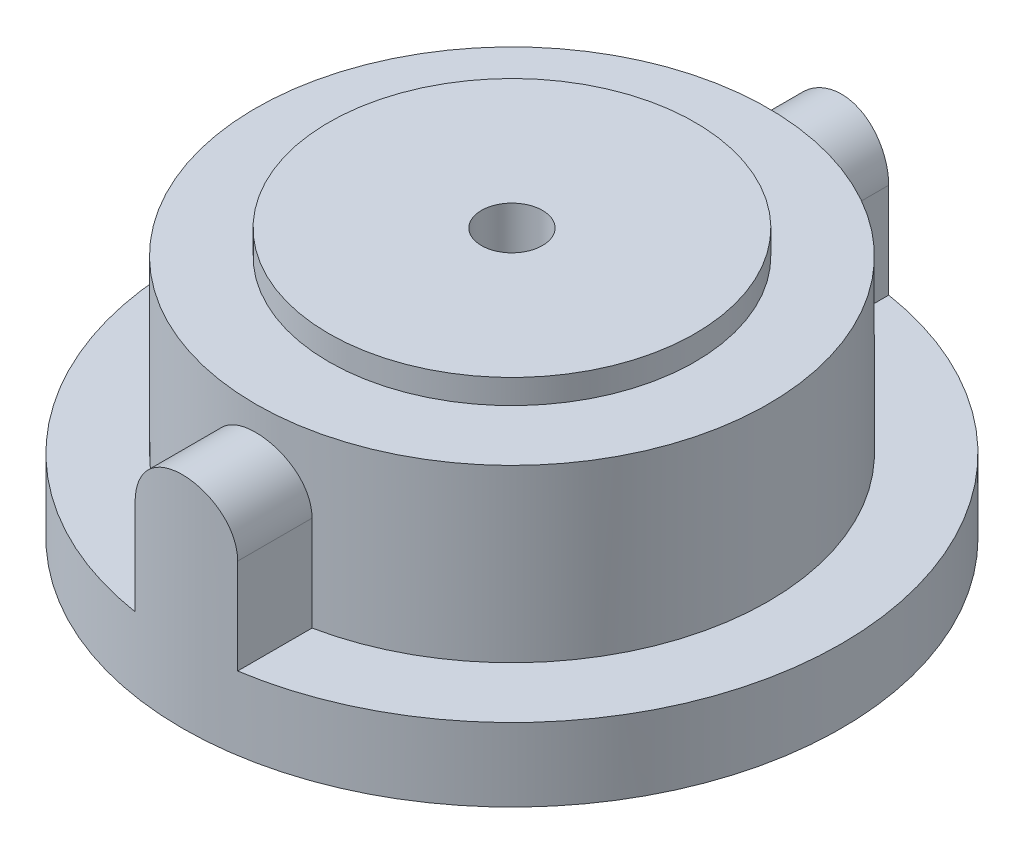
ISO-10303-21;
HEADER;
FILE_DESCRIPTION(('STEP AP214'),'2;1');
FILE_NAME('part.step','',(''),(''),'','','');
FILE_SCHEMA(('AUTOMOTIVE_DESIGN { 1 0 10303 214 1 1 1 1 }'));
ENDSEC;
DATA;
#1=APPLICATION_CONTEXT('core data for automotive mechanical design processes');
#2=APPLICATION_PROTOCOL_DEFINITION('international standard','automotive_design',2000,#1);
#3=PRODUCT_CONTEXT('',#1,'mechanical');
#4=PRODUCT('Part','Part','',(#3));
#5=PRODUCT_RELATED_PRODUCT_CATEGORY('part','',(#4));
#6=PRODUCT_DEFINITION_FORMATION('','',#4);
#7=PRODUCT_DEFINITION_CONTEXT('part definition',#1,'design');
#8=PRODUCT_DEFINITION('design','',#6,#7);
#9=PRODUCT_DEFINITION_SHAPE('','',#8);
#10=(LENGTH_UNIT() NAMED_UNIT(*) SI_UNIT(.MILLI.,.METRE.));
#11=(NAMED_UNIT(*) PLANE_ANGLE_UNIT() SI_UNIT($,.RADIAN.));
#12=(NAMED_UNIT(*) SI_UNIT($,.STERADIAN.) SOLID_ANGLE_UNIT());
#13=UNCERTAINTY_MEASURE_WITH_UNIT(LENGTH_MEASURE(1.E-05),#10,'distance_accuracy_value','');
#14=(GEOMETRIC_REPRESENTATION_CONTEXT(3) GLOBAL_UNCERTAINTY_ASSIGNED_CONTEXT((#13)) GLOBAL_UNIT_ASSIGNED_CONTEXT((#10,
#11,#12)) REPRESENTATION_CONTEXT('',''));
#15=CARTESIAN_POINT('',(0.,0.,0.));
#16=DIRECTION('',(0.,0.,1.));
#17=DIRECTION('',(1.,0.,0.));
#18=AXIS2_PLACEMENT_3D('',#15,#16,#17);
#19=CARTESIAN_POINT('',(0.,10.,0.));
#20=DIRECTION('',(0.,1.,0.));
#21=DIRECTION('',(0.,0.,1.));
#22=AXIS2_PLACEMENT_3D('',#19,#20,#21);
#23=PLANE('',#22);
#24=CARTESIAN_POINT('',(0.,10.,0.));
#25=DIRECTION('',(0.,1.,0.));
#26=DIRECTION('',(0.,0.,1.));
#27=AXIS2_PLACEMENT_3D('',#24,#25,#26);
#28=CIRCLE('',#27,10.5);
#29=CARTESIAN_POINT('',(0.,10.,10.5));
#30=VERTEX_POINT('',#29);
#31=EDGE_CURVE('E135',#30,#30,#28,.T.);
#32=ORIENTED_EDGE('',*,*,#31,.T.);
#33=EDGE_LOOP('',(#32));
#34=FACE_BOUND('',#33,.T.);
#35=CARTESIAN_POINT('',(0.,10.,0.));
#36=DIRECTION('',(0.,1.,0.));
#37=DIRECTION('',(0.,0.,1.));
#38=AXIS2_PLACEMENT_3D('',#35,#36,#37);
#39=CIRCLE('',#38,7.5);
#40=CARTESIAN_POINT('',(0.,10.,7.5));
#41=VERTEX_POINT('',#40);
#42=EDGE_CURVE('E235',#41,#41,#39,.T.);
#43=ORIENTED_EDGE('',*,*,#42,.F.);
#44=EDGE_LOOP('',(#43));
#45=FACE_BOUND('',#44,.T.);
#46=ADVANCED_FACE('F38',(#34,#45),#23,.T.);
#47=CARTESIAN_POINT('',(0.,3.,0.));
#48=DIRECTION('',(0.,1.,0.));
#49=DIRECTION('',(0.,0.,1.));
#50=AXIS2_PLACEMENT_3D('',#47,#48,#49);
#51=PLANE('',#50);
#52=CARTESIAN_POINT('',(0.,3.,0.));
#53=DIRECTION('',(0.,1.,0.));
#54=DIRECTION('',(0.,0.,1.));
#55=AXIS2_PLACEMENT_3D('',#52,#53,#54);
#56=CIRCLE('',#55,13.5);
#57=CARTESIAN_POINT('',(-2.1,3.,-13.3356664625357));
#58=VERTEX_POINT('',#57);
#59=CARTESIAN_POINT('',(-2.1,3.,13.3356664625357));
#60=VERTEX_POINT('',#59);
#61=EDGE_CURVE('E12',#58,#60,#56,.T.);
#62=ORIENTED_EDGE('',*,*,#61,.T.);
#63=DIRECTION('',(0.,0.,1.));
#64=VECTOR('',#63,1.);
#65=CARTESIAN_POINT('',(-2.1,3.,0.));
#66=LINE('',#65,#64);
#67=CARTESIAN_POINT('',(-2.1,3.,10.2878569196893));
#68=VERTEX_POINT('',#67);
#69=EDGE_CURVE('E148',#68,#60,#66,.T.);
#70=ORIENTED_EDGE('',*,*,#69,.F.);
#71=CARTESIAN_POINT('',(0.,3.,0.));
#72=DIRECTION('',(0.,1.,0.));
#73=DIRECTION('',(0.,0.,1.));
#74=AXIS2_PLACEMENT_3D('',#71,#72,#73);
#75=CIRCLE('',#74,10.5);
#76=CARTESIAN_POINT('',(-2.1,3.,-10.2878569196893));
#77=VERTEX_POINT('',#76);
#78=EDGE_CURVE('E130',#77,#68,#75,.T.);
#79=ORIENTED_EDGE('',*,*,#78,.F.);
#80=DIRECTION('',(0.,0.,1.));
#81=VECTOR('',#80,1.);
#82=CARTESIAN_POINT('',(-2.1,3.,0.));
#83=LINE('',#82,#81);
#84=EDGE_CURVE('E146',#58,#77,#83,.T.);
#85=ORIENTED_EDGE('',*,*,#84,.F.);
#86=EDGE_LOOP('',(#62,#70,#79,#85));
#87=FACE_BOUND('',#86,.T.);
#88=ADVANCED_FACE('F145',(#87),#51,.T.);
#89=DIRECTION('',(0.,0.,1.));
#90=VECTOR('',#89,1.);
#91=CARTESIAN_POINT('',(2.1,3.,0.));
#92=LINE('',#91,#90);
#93=CARTESIAN_POINT('',(2.1,3.,10.2878569196893));
#94=VERTEX_POINT('',#93);
#95=CARTESIAN_POINT('',(2.1,3.,13.3356664625357));
#96=VERTEX_POINT('',#95);
#97=EDGE_CURVE('E152',#94,#96,#92,.T.);
#98=ORIENTED_EDGE('',*,*,#97,.T.);
#99=CARTESIAN_POINT('',(2.1,3.,-13.3356664625357));
#100=VERTEX_POINT('',#99);
#101=EDGE_CURVE('E48',#96,#100,#56,.T.);
#102=ORIENTED_EDGE('',*,*,#101,.T.);
#103=DIRECTION('',(0.,0.,1.));
#104=VECTOR('',#103,1.);
#105=CARTESIAN_POINT('',(2.1,3.,0.));
#106=LINE('',#105,#104);
#107=CARTESIAN_POINT('',(2.1,3.,-10.2878569196893));
#108=VERTEX_POINT('',#107);
#109=EDGE_CURVE('E127',#100,#108,#106,.T.);
#110=ORIENTED_EDGE('',*,*,#109,.T.);
#111=EDGE_CURVE('E128',#94,#108,#75,.T.);
#112=ORIENTED_EDGE('',*,*,#111,.F.);
#113=EDGE_LOOP('',(#98,#102,#110,#112));
#114=FACE_BOUND('',#113,.T.);
#115=ADVANCED_FACE('F215',(#114),#51,.T.);
#116=CARTESIAN_POINT('',(0.,3.,0.));
#117=DIRECTION('',(0.,-1.,0.));
#118=DIRECTION('',(0.,0.,-1.));
#119=AXIS2_PLACEMENT_3D('',#116,#117,#118);
#120=CYLINDRICAL_SURFACE('',#119,13.5);
#121=DIRECTION('',(0.,-1.,0.));
#122=VECTOR('',#121,1.);
#123=CARTESIAN_POINT('',(-2.1,9.,-13.3356664625357));
#124=LINE('',#123,#122);
#125=CARTESIAN_POINT('',(-2.1,6.9,-13.3356664625357));
#126=VERTEX_POINT('',#125);
#127=EDGE_CURVE('E116',#126,#58,#124,.T.);
#128=ORIENTED_EDGE('',*,*,#127,.F.);
#129=CARTESIAN_POINT('',(-2.1,6.9,-13.3356664625357));
#130=CARTESIAN_POINT('',(-2.10000003362047,6.95870064975644,-13.3356641924813));
#131=CARTESIAN_POINT('',(-2.09753718442339,7.01737282326694,-13.3360545372154));
#132=CARTESIAN_POINT('',(-2.08771466942251,7.13429025313571,-13.3375966363139));
#133=CARTESIAN_POINT('',(-2.08035546026241,7.1925355487933,-13.3387483196744));
#134=CARTESIAN_POINT('',(-2.05101691857918,7.36585110547564,-13.3433034163251));
#135=CARTESIAN_POINT('',(-2.02177638968423,7.47974922625254,-13.3478070717655));
#136=CARTESIAN_POINT('',(-1.94479542652673,7.7009419188319,-13.3592389651343));
#137=CARTESIAN_POINT('',(-1.89705034064441,7.80823482236972,-13.3661678126576));
#138=CARTESIAN_POINT('',(-1.78444149214663,8.01330367226304,-13.3816660788076));
#139=CARTESIAN_POINT('',(-1.71957796427913,8.11107974909915,-13.3902354749366));
#140=CARTESIAN_POINT('',(-1.57398954621819,8.29514623524382,-13.4081303916358));
#141=CARTESIAN_POINT('',(-1.49314804578038,8.38134387123822,-13.4174611558056));
#142=CARTESIAN_POINT('',(-1.31814041919038,8.53901783325354,-13.4357817984866));
#143=CARTESIAN_POINT('',(-1.22397225856053,8.61049190744401,-13.4447716246833));
#144=CARTESIAN_POINT('',(-1.02438784875639,8.73702513755457,-13.4614521336257));
#145=CARTESIAN_POINT('',(-0.918916079951185,8.79199771152558,-13.4691358752226));
#146=CARTESIAN_POINT('',(-0.700102697374807,8.88340913153472,-13.4822792677039));
#147=CARTESIAN_POINT('',(-0.586761984493241,8.91985009523253,-13.4877391726982));
#148=CARTESIAN_POINT('',(-0.356389997957338,8.9728831296207,-13.4957829343775));
#149=CARTESIAN_POINT('',(-0.239395748450929,8.98963251894735,-13.4983895744565));
#150=CARTESIAN_POINT('',(-0.00422748842160446,9.00329577981471,-13.5005112868534));
#151=CARTESIAN_POINT('',(0.113946479814668,9.00021035979705,-13.5000264695892));
#152=CARTESIAN_POINT('',(0.347039414846936,8.97441453493813,-13.496037927127));
#153=CARTESIAN_POINT('',(0.461977684054823,8.95187393390199,-13.4925603235789));
#154=CARTESIAN_POINT('',(0.686419639987496,8.88807452940592,-13.4830060947168));
#155=CARTESIAN_POINT('',(0.795923211468582,8.84681532920286,-13.4769294143153));
#156=CARTESIAN_POINT('',(1.00690104171795,8.7465769447084,-13.4628149236582));
#157=CARTESIAN_POINT('',(1.10834086949709,8.68752644481789,-13.4547692456007));
#158=CARTESIAN_POINT('',(1.29993185871036,8.5534359883775,-13.4376129931583));
#159=CARTESIAN_POINT('',(1.3900826581905,8.47839551935821,-13.4285023846472));
#160=CARTESIAN_POINT('',(1.55753154571329,8.31352226052372,-13.4101185109453));
#161=CARTESIAN_POINT('',(1.63468545403143,8.22354306385022,-13.4008445409391));
#162=CARTESIAN_POINT('',(1.77284400077424,8.03180681211434,-13.3832690905538));
#163=CARTESIAN_POINT('',(1.8338439837955,7.93004637392989,-13.3749678909009));
#164=CARTESIAN_POINT('',(1.93798537767085,7.71746636610599,-13.3602766994743));
#165=CARTESIAN_POINT('',(1.98110065772168,7.60663382238528,-13.3538895079535));
#166=CARTESIAN_POINT('',(2.04800168154079,7.37925590665674,-13.3437945541188));
#167=CARTESIAN_POINT('',(2.07181637565083,7.26271936996768,-13.3400827796824));
#168=CARTESIAN_POINT('',(2.09043068831553,7.10442533170969,-13.3371702629415));
#169=CARTESIAN_POINT('',(2.09402074286844,7.0635885683473,-13.3366068099894));
#170=CARTESIAN_POINT('',(2.09880224708332,6.98184043580226,-13.3358553072576));
#171=CARTESIAN_POINT('',(2.09999772978293,6.94092930841583,-13.3356666262758));
#172=CARTESIAN_POINT('',(2.1,6.9,-13.3356664625357));
#173=B_SPLINE_CURVE_WITH_KNOTS('',3,(#129,#130,#131,#132,#133,#134,#135,#136,#137,#138,#139,
#140,#141,#142,#143,#144,#145,#146,#147,#148,#149,#150,#151,#152,#153,#154,#155,#156,#157,#158,
#159,#160,#161,#162,#163,#164,#165,#166,#167,#168,#169,#170,#171,#172),.UNSPECIFIED.,.F.,.F.,(4,
2,2,2,2,2,2,2,2,2,2,2,2,2,2,2,2,2,2,2,2,4),(0.,0.175992648583785,0.351968886063719,
0.703186358986229,1.05449217722208,1.40579317819486,1.75975958958644,2.11378009668888,
2.46962689410512,2.8254330187558,3.17837681566582,3.53130800652138,3.88118962777616,
4.23107866516356,4.58238930994889,4.93371121573431,5.28870501228497,5.64380100351718,
5.99941400282056,6.35449260012318,6.47743357075108,6.60016730437931),.UNSPECIFIED.);
#174=CARTESIAN_POINT('',(2.1,6.9,-13.3356664625357));
#175=VERTEX_POINT('',#174);
#176=EDGE_CURVE('E108',#126,#175,#173,.T.);
#177=ORIENTED_EDGE('',*,*,#176,.T.);
#178=DIRECTION('',(0.,-1.,0.));
#179=VECTOR('',#178,1.);
#180=CARTESIAN_POINT('',(2.1,9.,-13.3356664625357));
#181=LINE('',#180,#179);
#182=EDGE_CURVE('E113',#175,#100,#181,.T.);
#183=ORIENTED_EDGE('',*,*,#182,.T.);
#184=ORIENTED_EDGE('',*,*,#101,.F.);
#185=DIRECTION('',(0.,-1.,0.));
#186=VECTOR('',#185,1.);
#187=CARTESIAN_POINT('',(2.1,9.,13.3356664625357));
#188=LINE('',#187,#186);
#189=CARTESIAN_POINT('',(2.1,6.9,13.3356664625357));
#190=VERTEX_POINT('',#189);
#191=EDGE_CURVE('E151',#190,#96,#188,.T.);
#192=ORIENTED_EDGE('',*,*,#191,.F.);
#193=CARTESIAN_POINT('',(2.1,6.9,13.3356664625357));
#194=CARTESIAN_POINT('',(2.10000003362047,6.95870064975644,13.3356641924813));
#195=CARTESIAN_POINT('',(2.09753718442339,7.01737282326694,13.3360545372154));
#196=CARTESIAN_POINT('',(2.08771466942252,7.13429025313571,13.3375966363139));
#197=CARTESIAN_POINT('',(2.08035546026242,7.1925355487933,13.3387483196744));
#198=CARTESIAN_POINT('',(2.05101691857918,7.36585110547564,13.3433034163251));
#199=CARTESIAN_POINT('',(2.02177638968423,7.47974922625254,13.3478070717655));
#200=CARTESIAN_POINT('',(1.94479542652673,7.7009419188319,13.3592389651343));
#201=CARTESIAN_POINT('',(1.89705034064441,7.80823482236972,13.3661678126576));
#202=CARTESIAN_POINT('',(1.78444149214663,8.01330367226304,13.3816660788076));
#203=CARTESIAN_POINT('',(1.71957796427913,8.11107974909915,13.3902354749366));
#204=CARTESIAN_POINT('',(1.57398954621819,8.29514623524382,13.4081303916358));
#205=CARTESIAN_POINT('',(1.49314804578038,8.38134387123821,13.4174611558056));
#206=CARTESIAN_POINT('',(1.31814041919039,8.53901783325354,13.4357817984866));
#207=CARTESIAN_POINT('',(1.22397225856054,8.61049190744401,13.4447716246833));
#208=CARTESIAN_POINT('',(1.0243878487564,8.73702513755457,13.4614521336257));
#209=CARTESIAN_POINT('',(0.918916079951187,8.79199771152558,13.4691358752226));
#210=CARTESIAN_POINT('',(0.700102697374809,8.88340913153472,13.4822792677039));
#211=CARTESIAN_POINT('',(0.586761984493243,8.91985009523253,13.4877391726982));
#212=CARTESIAN_POINT('',(0.35638999795734,8.9728831296207,13.4957829343775));
#213=CARTESIAN_POINT('',(0.239395748450931,8.98963251894735,13.4983895744565));
#214=CARTESIAN_POINT('',(0.00422748842160757,9.00329577981471,13.5005112868534));
#215=CARTESIAN_POINT('',(-0.113946479814665,9.00021035979705,13.5000264695892));
#216=CARTESIAN_POINT('',(-0.347039414846933,8.97441453493813,13.496037927127));
#217=CARTESIAN_POINT('',(-0.461977684054821,8.95187393390199,13.4925603235789));
#218=CARTESIAN_POINT('',(-0.686419639987493,8.88807452940592,13.4830060947168));
#219=CARTESIAN_POINT('',(-0.795923211468579,8.84681532920286,13.4769294143153));
#220=CARTESIAN_POINT('',(-1.00690104171795,8.7465769447084,13.4628149236582));
#221=CARTESIAN_POINT('',(-1.10834086949709,8.68752644481789,13.4547692456007));
#222=CARTESIAN_POINT('',(-1.29993185871036,8.5534359883775,13.4376129931583));
#223=CARTESIAN_POINT('',(-1.3900826581905,8.47839551935821,13.4285023846472));
#224=CARTESIAN_POINT('',(-1.55753154571328,8.31352226052371,13.4101185109453));
#225=CARTESIAN_POINT('',(-1.63468545403143,8.22354306385022,13.4008445409391));
#226=CARTESIAN_POINT('',(-1.77284400077423,8.03180681211434,13.3832690905538));
#227=CARTESIAN_POINT('',(-1.83384398379549,7.93004637392989,13.3749678909009));
#228=CARTESIAN_POINT('',(-1.93798537767085,7.71746636610599,13.3602766994743));
#229=CARTESIAN_POINT('',(-1.98110065772168,7.60663382238528,13.3538895079535));
#230=CARTESIAN_POINT('',(-2.04800168154079,7.37925590665674,13.3437945541188));
#231=CARTESIAN_POINT('',(-2.07181637565083,7.26271936996768,13.3400827796824));
#232=CARTESIAN_POINT('',(-2.09043068831552,7.10442533170969,13.3371702629415));
#233=CARTESIAN_POINT('',(-2.09402074286844,7.0635885683473,13.3366068099894));
#234=CARTESIAN_POINT('',(-2.09880224708332,6.98184043580227,13.3358553072576));
#235=CARTESIAN_POINT('',(-2.09999772978292,6.94092930841583,13.3356666262758));
#236=CARTESIAN_POINT('',(-2.1,6.9,13.3356664625357));
#237=B_SPLINE_CURVE_WITH_KNOTS('',3,(#193,#194,#195,#196,#197,#198,#199,#200,#201,#202,#203,
#204,#205,#206,#207,#208,#209,#210,#211,#212,#213,#214,#215,#216,#217,#218,#219,#220,#221,#222,
#223,#224,#225,#226,#227,#228,#229,#230,#231,#232,#233,#234,#235,#236),.UNSPECIFIED.,.F.,.F.,(4,
2,2,2,2,2,2,2,2,2,2,2,2,2,2,2,2,2,2,2,2,4),(0.,0.175992648583785,0.351968886063719,
0.703186358986229,1.05449217722208,1.40579317819485,1.75975958958644,2.11378009668888,
2.46962689410512,2.8254330187558,3.17837681566581,3.53130800652137,3.88118962777616,
4.23107866516356,4.58238930994889,4.93371121573431,5.28870501228497,5.64380100351717,
5.99941400282056,6.35449260012317,6.47743357075107,6.60016730437931),.UNSPECIFIED.);
#238=CARTESIAN_POINT('',(-2.1,6.9,13.3356664625357));
#239=VERTEX_POINT('',#238);
#240=EDGE_CURVE('E170',#190,#239,#237,.T.);
#241=ORIENTED_EDGE('',*,*,#240,.T.);
#242=DIRECTION('',(0.,-1.,0.));
#243=VECTOR('',#242,1.);
#244=CARTESIAN_POINT('',(-2.1,9.,13.3356664625357));
#245=LINE('',#244,#243);
#246=EDGE_CURVE('E154',#239,#60,#245,.T.);
#247=ORIENTED_EDGE('',*,*,#246,.T.);
#248=ORIENTED_EDGE('',*,*,#61,.F.);
#249=EDGE_LOOP('',(#128,#177,#183,#184,#192,#241,#247,#248));
#250=FACE_BOUND('',#249,.T.);
#251=CARTESIAN_POINT('',(0.,0.,0.));
#252=DIRECTION('',(0.,1.,0.));
#253=DIRECTION('',(0.,0.,1.));
#254=AXIS2_PLACEMENT_3D('',#251,#252,#253);
#255=CIRCLE('',#254,13.5);
#256=CARTESIAN_POINT('',(0.,0.,13.5));
#257=VERTEX_POINT('',#256);
#258=EDGE_CURVE('E43',#257,#257,#255,.T.);
#259=ORIENTED_EDGE('',*,*,#258,.T.);
#260=EDGE_LOOP('',(#259));
#261=FACE_BOUND('',#260,.T.);
#262=ADVANCED_FACE('F40',(#250,#261),#120,.T.);
#263=CARTESIAN_POINT('',(0.,0.,0.));
#264=DIRECTION('',(0.,1.,0.));
#265=DIRECTION('',(0.,0.,1.));
#266=AXIS2_PLACEMENT_3D('',#263,#264,#265);
#267=PLANE('',#266);
#268=CARTESIAN_POINT('',(0.,0.,0.));
#269=DIRECTION('',(0.,-1.,0.));
#270=DIRECTION('',(0.,0.,-1.));
#271=AXIS2_PLACEMENT_3D('',#268,#269,#270);
#272=CIRCLE('',#271,1.25);
#273=CARTESIAN_POINT('',(0.,0.,-1.25));
#274=VERTEX_POINT('',#273);
#275=EDGE_CURVE('E242',#274,#274,#272,.T.);
#276=ORIENTED_EDGE('',*,*,#275,.F.);
#277=EDGE_LOOP('',(#276));
#278=FACE_BOUND('',#277,.T.);
#279=ORIENTED_EDGE('',*,*,#258,.F.);
#280=EDGE_LOOP('',(#279));
#281=FACE_BOUND('',#280,.T.);
#282=ADVANCED_FACE('F213',(#278,#281),#267,.F.);
#283=CARTESIAN_POINT('',(0.,10.,0.));
#284=DIRECTION('',(0.,-1.,0.));
#285=DIRECTION('',(0.,0.,-1.));
#286=AXIS2_PLACEMENT_3D('',#283,#284,#285);
#287=CYLINDRICAL_SURFACE('',#286,10.5);
#288=DIRECTION('',(0.,-1.,0.));
#289=VECTOR('',#288,1.);
#290=CARTESIAN_POINT('',(2.1,9.,-10.2878569196893));
#291=LINE('',#290,#289);
#292=CARTESIAN_POINT('',(2.1,6.9,-10.2878569196893));
#293=VERTEX_POINT('',#292);
#294=EDGE_CURVE('E55',#293,#108,#291,.T.);
#295=ORIENTED_EDGE('',*,*,#294,.F.);
#296=CARTESIAN_POINT('',(2.1,6.9,-10.2878569196893));
#297=CARTESIAN_POINT('',(2.10000031194499,6.95845049416363,-10.2878539171573));
#298=CARTESIAN_POINT('',(2.09755812425924,7.01687239074517,-10.288355683887));
#299=CARTESIAN_POINT('',(2.08781986170616,7.13328630745091,-10.2903374505764));
#300=CARTESIAN_POINT('',(2.0805243872912,7.19127837985595,-10.2918173295231));
#301=CARTESIAN_POINT('',(2.05145051952649,7.36379537431664,-10.2976679744941));
#302=CARTESIAN_POINT('',(2.02248433062436,7.47714600041121,-10.3034500459648));
#303=CARTESIAN_POINT('',(1.9462733014477,7.69724945315809,-10.3181154342176));
#304=CARTESIAN_POINT('',(1.8990264433902,7.80400154996915,-10.3269990933361));
#305=CARTESIAN_POINT('',(1.78763361926069,8.00809625614772,-10.3468621227054));
#306=CARTESIAN_POINT('',(1.72348590169835,8.10543788884861,-10.3578417101316));
#307=CARTESIAN_POINT('',(1.5791590696275,8.28927565703857,-10.3808307797072));
#308=CARTESIAN_POINT('',(1.49878869382543,8.3756201926817,-10.3928514666497));
#309=CARTESIAN_POINT('',(1.32470224108288,8.53370432250387,-10.4164709378978));
#310=CARTESIAN_POINT('',(1.23098410016753,8.60544165378401,-10.4280696566051));
#311=CARTESIAN_POINT('',(1.03185611214062,8.73285669193984,-10.4496590189784));
#312=CARTESIAN_POINT('',(0.926351632027486,8.78838923534584,-10.4596347929221));
#313=CARTESIAN_POINT('',(0.707282524428689,8.88087935755453,-10.4767268645444));
#314=CARTESIAN_POINT('',(0.59371909201272,8.91783968390741,-10.4838435851564));
#315=CARTESIAN_POINT('',(0.363336558662914,8.97166480178475,-10.4943366733168));
#316=CARTESIAN_POINT('',(0.246579972609596,8.98878765791618,-10.4977610329523));
#317=CARTESIAN_POINT('',(0.0118017411731779,9.00325705682065,-10.5006493566685));
#318=CARTESIAN_POINT('',(-0.106219811023037,9.00060504649472,-10.500113610505));
#319=CARTESIAN_POINT('',(-0.338398625789051,8.97579497921964,-10.4951791233203));
#320=CARTESIAN_POINT('',(-0.45258698805018,8.95391539519998,-10.4908355334659));
#321=CARTESIAN_POINT('',(-0.675637213763575,8.89171312835031,-10.4788356645369));
#322=CARTESIAN_POINT('',(-0.784498902896672,8.85138984238328,-10.4711792771292));
#323=CARTESIAN_POINT('',(-0.994602569757213,8.75318615265978,-10.453323071531));
#324=CARTESIAN_POINT('',(-1.09579202631459,8.6951963674555,-10.443107480213));
#325=CARTESIAN_POINT('',(-1.28710351955443,8.56338843241897,-10.4212594842126));
#326=CARTESIAN_POINT('',(-1.37722463806238,8.48956897082812,-10.4096269621479));
#327=CARTESIAN_POINT('',(-1.54548703373101,8.32668044058704,-10.3859917847386));
#328=CARTESIAN_POINT('',(-1.62339385949169,8.23736945564972,-10.3739862080765));
#329=CARTESIAN_POINT('',(-1.76318288978884,8.04680000717334,-10.3511458284449));
#330=CARTESIAN_POINT('',(-1.82506065508521,7.94553824515088,-10.3403113502936));
#331=CARTESIAN_POINT('',(-1.93111790475401,7.73358994961358,-10.3210323308887));
#332=CARTESIAN_POINT('',(-1.97524924093245,7.6228787508672,-10.3125943094652));
#333=CARTESIAN_POINT('',(-2.04415490439281,7.39547687436306,-10.2991593823124));
#334=CARTESIAN_POINT('',(-2.06895806771709,7.27879538203892,-10.294157351694));
#335=CARTESIAN_POINT('',(-2.08914917005613,7.11765068462249,-10.2900667210312));
#336=CARTESIAN_POINT('',(-2.09321963687657,7.07418630645688,-10.2892389573119));
#337=CARTESIAN_POINT('',(-2.09864164579577,6.98715448531141,-10.2881345151222));
#338=CARTESIAN_POINT('',(-2.09999773809978,6.94358733759285,-10.2878569144013));
#339=CARTESIAN_POINT('',(-2.1,6.9,-10.2878569196893));
#340=B_SPLINE_CURVE_WITH_KNOTS('',3,(#296,#297,#298,#299,#300,#301,#302,#303,#304,#305,#306,
#307,#308,#309,#310,#311,#312,#313,#314,#315,#316,#317,#318,#319,#320,#321,#322,#323,#324,#325,
#326,#327,#328,#329,#330,#331,#332,#333,#334,#335,#336,#337,#338,#339),.UNSPECIFIED.,.F.,.F.,(4,
2,2,2,2,2,2,2,2,2,2,2,2,2,2,2,2,2,2,2,2,4),(0.,0.175241871751633,0.350462066475223,
0.700058731089087,1.04969399448285,1.39936550596357,1.75342953378011,2.10754837034271,
2.46474834642953,2.82189546323662,3.17434236775853,3.52676348445606,3.87416308183209,
4.22157404051377,4.57118126967969,4.92081748096897,5.27650767345757,5.63229626909943,
5.98904375263664,6.3452579738636,6.47617741141929,6.60687719951593),.UNSPECIFIED.);
#341=CARTESIAN_POINT('',(-2.1,6.9,-10.2878569196893));
#342=VERTEX_POINT('',#341);
#343=EDGE_CURVE('E123',#293,#342,#340,.T.);
#344=ORIENTED_EDGE('',*,*,#343,.T.);
#345=DIRECTION('',(0.,-1.,0.));
#346=VECTOR('',#345,1.);
#347=CARTESIAN_POINT('',(-2.1,9.,-10.2878569196893));
#348=LINE('',#347,#346);
#349=EDGE_CURVE('E63',#342,#77,#348,.T.);
#350=ORIENTED_EDGE('',*,*,#349,.T.);
#351=ORIENTED_EDGE('',*,*,#78,.T.);
#352=DIRECTION('',(0.,-1.,0.));
#353=VECTOR('',#352,1.);
#354=CARTESIAN_POINT('',(-2.1,9.,10.2878569196893));
#355=LINE('',#354,#353);
#356=CARTESIAN_POINT('',(-2.1,6.9,10.2878569196893));
#357=VERTEX_POINT('',#356);
#358=EDGE_CURVE('E141',#357,#68,#355,.T.);
#359=ORIENTED_EDGE('',*,*,#358,.F.);
#360=CARTESIAN_POINT('',(2.1,6.9,10.2878569196893));
#361=CARTESIAN_POINT('',(2.10000031194499,6.95845049416363,10.2878539171573));
#362=CARTESIAN_POINT('',(2.09755812425924,7.01687239074517,10.288355683887));
#363=CARTESIAN_POINT('',(2.08781986170616,7.13328630745091,10.2903374505764));
#364=CARTESIAN_POINT('',(2.0805243872912,7.19127837985595,10.2918173295231));
#365=CARTESIAN_POINT('',(2.05145051952649,7.36379537431664,10.2976679744941));
#366=CARTESIAN_POINT('',(2.02248433062436,7.47714600041121,10.3034500459648));
#367=CARTESIAN_POINT('',(1.9462733014477,7.69724945315809,10.3181154342176));
#368=CARTESIAN_POINT('',(1.8990264433902,7.80400154996915,10.3269990933361));
#369=CARTESIAN_POINT('',(1.78763361926069,8.00809625614772,10.3468621227054));
#370=CARTESIAN_POINT('',(1.72348590169835,8.10543788884861,10.3578417101316));
#371=CARTESIAN_POINT('',(1.5791590696275,8.28927565703857,10.3808307797072));
#372=CARTESIAN_POINT('',(1.49878869382543,8.3756201926817,10.3928514666497));
#373=CARTESIAN_POINT('',(1.32470224108288,8.53370432250387,10.4164709378978));
#374=CARTESIAN_POINT('',(1.23098410016753,8.60544165378401,10.4280696566051));
#375=CARTESIAN_POINT('',(1.03185611214062,8.73285669193984,10.4496590189784));
#376=CARTESIAN_POINT('',(0.926351632027486,8.78838923534584,10.4596347929221));
#377=CARTESIAN_POINT('',(0.707282524428689,8.88087935755453,10.4767268645444));
#378=CARTESIAN_POINT('',(0.59371909201272,8.91783968390741,10.4838435851564));
#379=CARTESIAN_POINT('',(0.363336558662914,8.97166480178475,10.4943366733168));
#380=CARTESIAN_POINT('',(0.246579972609596,8.98878765791618,10.4977610329523));
#381=CARTESIAN_POINT('',(0.0118017411731779,9.00325705682065,10.5006493566685));
#382=CARTESIAN_POINT('',(-0.106219811023037,9.00060504649472,10.500113610505));
#383=CARTESIAN_POINT('',(-0.338398625789051,8.97579497921964,10.4951791233203));
#384=CARTESIAN_POINT('',(-0.45258698805018,8.95391539519998,10.4908355334659));
#385=CARTESIAN_POINT('',(-0.675637213763575,8.89171312835031,10.4788356645369));
#386=CARTESIAN_POINT('',(-0.784498902896672,8.85138984238328,10.4711792771292));
#387=CARTESIAN_POINT('',(-0.994602569757213,8.75318615265978,10.453323071531));
#388=CARTESIAN_POINT('',(-1.09579202631459,8.6951963674555,10.443107480213));
#389=CARTESIAN_POINT('',(-1.28710351955443,8.56338843241897,10.4212594842126));
#390=CARTESIAN_POINT('',(-1.37722463806238,8.48956897082812,10.4096269621479));
#391=CARTESIAN_POINT('',(-1.54548703373101,8.32668044058704,10.3859917847386));
#392=CARTESIAN_POINT('',(-1.62339385949169,8.23736945564972,10.3739862080765));
#393=CARTESIAN_POINT('',(-1.76318288978884,8.04680000717334,10.3511458284449));
#394=CARTESIAN_POINT('',(-1.82506065508521,7.94553824515088,10.3403113502936));
#395=CARTESIAN_POINT('',(-1.93111790475401,7.73358994961358,10.3210323308887));
#396=CARTESIAN_POINT('',(-1.97524924093245,7.6228787508672,10.3125943094652));
#397=CARTESIAN_POINT('',(-2.04415490439281,7.39547687436306,10.2991593823124));
#398=CARTESIAN_POINT('',(-2.06895806771709,7.27879538203892,10.294157351694));
#399=CARTESIAN_POINT('',(-2.08914917005613,7.11765068462249,10.2900667210312));
#400=CARTESIAN_POINT('',(-2.09321963687657,7.07418630645688,10.2892389573119));
#401=CARTESIAN_POINT('',(-2.09864164579577,6.98715448531141,10.2881345151222));
#402=CARTESIAN_POINT('',(-2.09999773809978,6.94358733759285,10.2878569144013));
#403=CARTESIAN_POINT('',(-2.1,6.9,10.2878569196893));
#404=B_SPLINE_CURVE_WITH_KNOTS('',3,(#360,#361,#362,#363,#364,#365,#366,#367,#368,#369,#370,
#371,#372,#373,#374,#375,#376,#377,#378,#379,#380,#381,#382,#383,#384,#385,#386,#387,#388,#389,
#390,#391,#392,#393,#394,#395,#396,#397,#398,#399,#400,#401,#402,#403),.UNSPECIFIED.,.F.,.F.,(4,
2,2,2,2,2,2,2,2,2,2,2,2,2,2,2,2,2,2,2,2,4),(0.,0.175241871751633,0.350462066475223,
0.700058731089087,1.04969399448285,1.39936550596357,1.75342953378011,2.10754837034271,
2.46474834642953,2.82189546323662,3.17434236775853,3.52676348445606,3.87416308183209,
4.22157404051377,4.57118126967969,4.92081748096897,5.27650767345757,5.63229626909943,
5.98904375263664,6.3452579738636,6.47617741141929,6.60687719951593),.UNSPECIFIED.);
#405=CARTESIAN_POINT('',(2.1,6.9,10.2878569196893));
#406=VERTEX_POINT('',#405);
#407=EDGE_CURVE('E157',#406,#357,#404,.T.);
#408=ORIENTED_EDGE('',*,*,#407,.F.);
#409=DIRECTION('',(0.,-1.,0.));
#410=VECTOR('',#409,1.);
#411=CARTESIAN_POINT('',(2.1,9.,10.2878569196893));
#412=LINE('',#411,#410);
#413=EDGE_CURVE('E163',#406,#94,#412,.T.);
#414=ORIENTED_EDGE('',*,*,#413,.T.);
#415=ORIENTED_EDGE('',*,*,#111,.T.);
#416=EDGE_LOOP('',(#295,#344,#350,#351,#359,#408,#414,#415));
#417=FACE_BOUND('',#416,.T.);
#418=ORIENTED_EDGE('',*,*,#31,.F.);
#419=EDGE_LOOP('',(#418));
#420=FACE_BOUND('',#419,.T.);
#421=ADVANCED_FACE('F139',(#417,#420),#287,.T.);
#422=CARTESIAN_POINT('',(2.1,9.,0.));
#423=DIRECTION('',(1.,0.,0.));
#424=DIRECTION('',(0.,0.,-1.));
#425=AXIS2_PLACEMENT_3D('',#422,#423,#424);
#426=PLANE('',#425);
#427=ORIENTED_EDGE('',*,*,#182,.F.);
#428=DIRECTION('',(0.,0.,1.));
#429=VECTOR('',#428,1.);
#430=CARTESIAN_POINT('',(2.1,6.9,-12.));
#431=LINE('',#430,#429);
#432=EDGE_CURVE('E119',#175,#293,#431,.T.);
#433=ORIENTED_EDGE('',*,*,#432,.T.);
#434=ORIENTED_EDGE('',*,*,#294,.T.);
#435=ORIENTED_EDGE('',*,*,#109,.F.);
#436=EDGE_LOOP('',(#427,#433,#434,#435));
#437=FACE_BOUND('',#436,.T.);
#438=ADVANCED_FACE('F125',(#437),#426,.T.);
#439=CARTESIAN_POINT('',(-2.1,9.,0.));
#440=DIRECTION('',(1.,0.,0.));
#441=DIRECTION('',(0.,0.,-1.));
#442=AXIS2_PLACEMENT_3D('',#439,#440,#441);
#443=PLANE('',#442);
#444=DIRECTION('',(0.,0.,1.));
#445=VECTOR('',#444,1.);
#446=CARTESIAN_POINT('',(-2.1,6.9,-12.));
#447=LINE('',#446,#445);
#448=EDGE_CURVE('E169',#126,#342,#447,.T.);
#449=ORIENTED_EDGE('',*,*,#448,.F.);
#450=ORIENTED_EDGE('',*,*,#127,.T.);
#451=ORIENTED_EDGE('',*,*,#84,.T.);
#452=ORIENTED_EDGE('',*,*,#349,.F.);
#453=EDGE_LOOP('',(#449,#450,#451,#452));
#454=FACE_BOUND('',#453,.T.);
#455=ADVANCED_FACE('F168',(#454),#443,.F.);
#456=CARTESIAN_POINT('',(2.1,9.,0.));
#457=DIRECTION('',(1.,0.,0.));
#458=DIRECTION('',(0.,0.,-1.));
#459=AXIS2_PLACEMENT_3D('',#456,#457,#458);
#460=PLANE('',#459);
#461=DIRECTION('',(0.,0.,-1.));
#462=VECTOR('',#461,1.);
#463=CARTESIAN_POINT('',(2.1,6.9,12.));
#464=LINE('',#463,#462);
#465=EDGE_CURVE('E173',#190,#406,#464,.T.);
#466=ORIENTED_EDGE('',*,*,#465,.F.);
#467=ORIENTED_EDGE('',*,*,#191,.T.);
#468=ORIENTED_EDGE('',*,*,#97,.F.);
#469=ORIENTED_EDGE('',*,*,#413,.F.);
#470=EDGE_LOOP('',(#466,#467,#468,#469));
#471=FACE_BOUND('',#470,.T.);
#472=ADVANCED_FACE('F293',(#471),#460,.T.);
#473=CARTESIAN_POINT('',(-2.1,9.,0.));
#474=DIRECTION('',(1.,0.,0.));
#475=DIRECTION('',(0.,0.,-1.));
#476=AXIS2_PLACEMENT_3D('',#473,#474,#475);
#477=PLANE('',#476);
#478=ORIENTED_EDGE('',*,*,#246,.F.);
#479=DIRECTION('',(0.,0.,-1.));
#480=VECTOR('',#479,1.);
#481=CARTESIAN_POINT('',(-2.1,6.9,12.));
#482=LINE('',#481,#480);
#483=EDGE_CURVE('E207',#239,#357,#482,.T.);
#484=ORIENTED_EDGE('',*,*,#483,.T.);
#485=ORIENTED_EDGE('',*,*,#358,.T.);
#486=ORIENTED_EDGE('',*,*,#69,.T.);
#487=EDGE_LOOP('',(#478,#484,#485,#486));
#488=FACE_BOUND('',#487,.T.);
#489=ADVANCED_FACE('F200',(#488),#477,.F.);
#490=CARTESIAN_POINT('',(0.,6.9,12.));
#491=DIRECTION('',(0.,0.,-1.));
#492=DIRECTION('',(-1.,0.,0.));
#493=AXIS2_PLACEMENT_3D('',#490,#491,#492);
#494=CYLINDRICAL_SURFACE('',#493,2.1);
#495=ORIENTED_EDGE('',*,*,#240,.F.);
#496=ORIENTED_EDGE('',*,*,#465,.T.);
#497=ORIENTED_EDGE('',*,*,#407,.T.);
#498=ORIENTED_EDGE('',*,*,#483,.F.);
#499=EDGE_LOOP('',(#495,#496,#497,#498));
#500=FACE_BOUND('',#499,.T.);
#501=ADVANCED_FACE('F196',(#500),#494,.T.);
#502=CARTESIAN_POINT('',(0.,6.9,-12.));
#503=DIRECTION('',(0.,0.,1.));
#504=DIRECTION('',(1.,0.,0.));
#505=AXIS2_PLACEMENT_3D('',#502,#503,#504);
#506=CYLINDRICAL_SURFACE('',#505,2.1);
#507=ORIENTED_EDGE('',*,*,#432,.F.);
#508=ORIENTED_EDGE('',*,*,#176,.F.);
#509=ORIENTED_EDGE('',*,*,#448,.T.);
#510=ORIENTED_EDGE('',*,*,#343,.F.);
#511=EDGE_LOOP('',(#507,#508,#509,#510));
#512=FACE_BOUND('',#511,.T.);
#513=ADVANCED_FACE('F122',(#512),#506,.T.);
#514=CARTESIAN_POINT('',(0.,11.,0.));
#515=DIRECTION('',(0.,-1.,0.));
#516=DIRECTION('',(0.,0.,-1.));
#517=AXIS2_PLACEMENT_3D('',#514,#515,#516);
#518=CYLINDRICAL_SURFACE('',#517,7.5);
#519=CARTESIAN_POINT('',(0.,11.,0.));
#520=DIRECTION('',(0.,1.,0.));
#521=DIRECTION('',(0.,0.,1.));
#522=AXIS2_PLACEMENT_3D('',#519,#520,#521);
#523=CIRCLE('',#522,7.5);
#524=CARTESIAN_POINT('',(0.,11.,7.5));
#525=VERTEX_POINT('',#524);
#526=EDGE_CURVE('E120',#525,#525,#523,.T.);
#527=ORIENTED_EDGE('',*,*,#526,.F.);
#528=EDGE_LOOP('',(#527));
#529=FACE_BOUND('',#528,.T.);
#530=ORIENTED_EDGE('',*,*,#42,.T.);
#531=EDGE_LOOP('',(#530));
#532=FACE_BOUND('',#531,.T.);
#533=ADVANCED_FACE('F250',(#529,#532),#518,.T.);
#534=CARTESIAN_POINT('',(0.,11.,0.));
#535=DIRECTION('',(0.,1.,0.));
#536=DIRECTION('',(0.,0.,1.));
#537=AXIS2_PLACEMENT_3D('',#534,#535,#536);
#538=PLANE('',#537);
#539=CARTESIAN_POINT('',(0.,11.,0.));
#540=DIRECTION('',(0.,-1.,0.));
#541=DIRECTION('',(0.,0.,-1.));
#542=AXIS2_PLACEMENT_3D('',#539,#540,#541);
#543=CIRCLE('',#542,1.25);
#544=CARTESIAN_POINT('',(0.,11.,-1.25));
#545=VERTEX_POINT('',#544);
#546=EDGE_CURVE('E237',#545,#545,#543,.T.);
#547=ORIENTED_EDGE('',*,*,#546,.T.);
#548=EDGE_LOOP('',(#547));
#549=FACE_BOUND('',#548,.T.);
#550=ORIENTED_EDGE('',*,*,#526,.T.);
#551=EDGE_LOOP('',(#550));
#552=FACE_BOUND('',#551,.T.);
#553=ADVANCED_FACE('F253',(#549,#552),#538,.T.);
#554=CARTESIAN_POINT('',(0.,11.,0.));
#555=DIRECTION('',(0.,-1.,0.));
#556=DIRECTION('',(0.,0.,-1.));
#557=AXIS2_PLACEMENT_3D('',#554,#555,#556);
#558=CYLINDRICAL_SURFACE('',#557,1.25);
#559=ORIENTED_EDGE('',*,*,#546,.F.);
#560=EDGE_LOOP('',(#559));
#561=FACE_BOUND('',#560,.T.);
#562=ORIENTED_EDGE('',*,*,#275,.T.);
#563=EDGE_LOOP('',(#562));
#564=FACE_BOUND('',#563,.T.);
#565=ADVANCED_FACE('F257',(#561,#564),#558,.F.);
#566=CLOSED_SHELL('',(#46,#88,#115,#262,#282,#421,#438,#455,#472,#489,#501,#513,#533,#553,#565));
#567=MANIFOLD_SOLID_BREP('B2',#566);
#568=ADVANCED_BREP_SHAPE_REPRESENTATION('',(#18,#567),#14);
#569=SHAPE_DEFINITION_REPRESENTATION(#9,#568);
ENDSEC;
END-ISO-10303-21;
